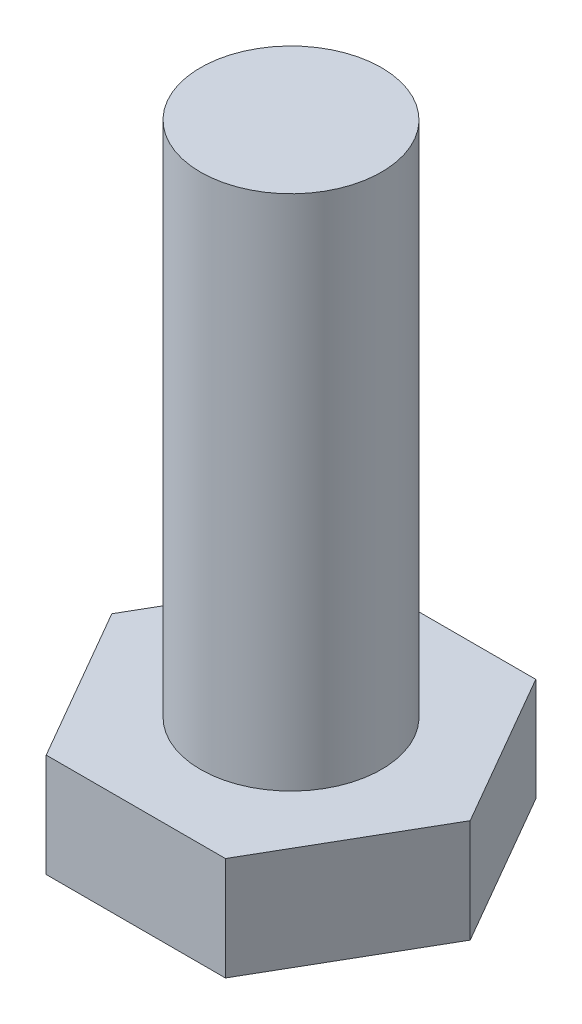
ISO-10303-21;
HEADER;
FILE_DESCRIPTION(('STEP AP214'),'2;1');
FILE_NAME('part.step','',(''),(''),'','','');
FILE_SCHEMA(('AUTOMOTIVE_DESIGN { 1 0 10303 214 1 1 1 1 }'));
ENDSEC;
DATA;
#1=APPLICATION_CONTEXT('core data for automotive mechanical design processes');
#2=APPLICATION_PROTOCOL_DEFINITION('international standard','automotive_design',2000,#1);
#3=PRODUCT_CONTEXT('',#1,'mechanical');
#4=PRODUCT('Part','Part','',(#3));
#5=PRODUCT_RELATED_PRODUCT_CATEGORY('part','',(#4));
#6=PRODUCT_DEFINITION_FORMATION('','',#4);
#7=PRODUCT_DEFINITION_CONTEXT('part definition',#1,'design');
#8=PRODUCT_DEFINITION('design','',#6,#7);
#9=PRODUCT_DEFINITION_SHAPE('','',#8);
#10=(LENGTH_UNIT() NAMED_UNIT(*) SI_UNIT(.MILLI.,.METRE.));
#11=(NAMED_UNIT(*) PLANE_ANGLE_UNIT() SI_UNIT($,.RADIAN.));
#12=(NAMED_UNIT(*) SI_UNIT($,.STERADIAN.) SOLID_ANGLE_UNIT());
#13=UNCERTAINTY_MEASURE_WITH_UNIT(LENGTH_MEASURE(1.E-05),#10,'distance_accuracy_value','');
#14=(GEOMETRIC_REPRESENTATION_CONTEXT(3) GLOBAL_UNCERTAINTY_ASSIGNED_CONTEXT((#13)) GLOBAL_UNIT_ASSIGNED_CONTEXT((#10,
#11,#12)) REPRESENTATION_CONTEXT('',''));
#15=CARTESIAN_POINT('',(0.,0.,0.));
#16=DIRECTION('',(0.,0.,1.));
#17=DIRECTION('',(1.,0.,0.));
#18=AXIS2_PLACEMENT_3D('',#15,#16,#17);
#19=CARTESIAN_POINT('',(1.73205080756888,2.,-3.));
#20=DIRECTION('',(0.,0.,1.));
#21=DIRECTION('',(1.,0.,0.));
#22=AXIS2_PLACEMENT_3D('',#19,#20,#21);
#23=PLANE('',#22);
#24=DIRECTION('',(-1.,0.,0.));
#25=VECTOR('',#24,1.);
#26=CARTESIAN_POINT('',(1.73205080756888,0.,-3.));
#27=LINE('',#26,#25);
#28=CARTESIAN_POINT('',(1.73205080756888,0.,-3.));
#29=VERTEX_POINT('',#28);
#30=CARTESIAN_POINT('',(-1.73205080756888,0.,-3.));
#31=VERTEX_POINT('',#30);
#32=EDGE_CURVE('E127',#29,#31,#27,.T.);
#33=ORIENTED_EDGE('',*,*,#32,.T.);
#34=DIRECTION('',(0.,-1.,0.));
#35=VECTOR('',#34,1.);
#36=CARTESIAN_POINT('',(-1.73205080756888,2.,-3.));
#37=LINE('',#36,#35);
#38=CARTESIAN_POINT('',(-1.73205080756888,2.,-3.));
#39=VERTEX_POINT('',#38);
#40=EDGE_CURVE('E44',#39,#31,#37,.T.);
#41=ORIENTED_EDGE('',*,*,#40,.F.);
#42=DIRECTION('',(-1.,0.,0.));
#43=VECTOR('',#42,1.);
#44=CARTESIAN_POINT('',(1.73205080756888,2.,-3.));
#45=LINE('',#44,#43);
#46=CARTESIAN_POINT('',(1.73205080756888,2.,-3.));
#47=VERTEX_POINT('',#46);
#48=EDGE_CURVE('E138',#47,#39,#45,.T.);
#49=ORIENTED_EDGE('',*,*,#48,.F.);
#50=DIRECTION('',(0.,-1.,0.));
#51=VECTOR('',#50,1.);
#52=CARTESIAN_POINT('',(1.73205080756888,2.,-3.));
#53=LINE('',#52,#51);
#54=EDGE_CURVE('E123',#47,#29,#53,.T.);
#55=ORIENTED_EDGE('',*,*,#54,.T.);
#56=EDGE_LOOP('',(#33,#41,#49,#55));
#57=FACE_BOUND('',#56,.T.);
#58=ADVANCED_FACE('F41',(#57),#23,.F.);
#59=CARTESIAN_POINT('',(-1.73205080756888,2.,-3.));
#60=DIRECTION('',(0.866025403784439,0.,0.5));
#61=DIRECTION('',(0.5,0.,-0.866025403784439));
#62=AXIS2_PLACEMENT_3D('',#59,#60,#61);
#63=PLANE('',#62);
#64=DIRECTION('',(-0.5,0.,0.866025403784439));
#65=VECTOR('',#64,1.);
#66=CARTESIAN_POINT('',(-1.73205080756888,0.,-3.));
#67=LINE('',#66,#65);
#68=CARTESIAN_POINT('',(-3.46410161513776,0.,0.));
#69=VERTEX_POINT('',#68);
#70=EDGE_CURVE('E130',#31,#69,#67,.T.);
#71=ORIENTED_EDGE('',*,*,#70,.T.);
#72=DIRECTION('',(0.,-1.,0.));
#73=VECTOR('',#72,1.);
#74=CARTESIAN_POINT('',(-3.46410161513776,2.,0.));
#75=LINE('',#74,#73);
#76=CARTESIAN_POINT('',(-3.46410161513776,2.,0.));
#77=VERTEX_POINT('',#76);
#78=EDGE_CURVE('E141',#77,#69,#75,.T.);
#79=ORIENTED_EDGE('',*,*,#78,.F.);
#80=DIRECTION('',(-0.5,0.,0.866025403784439));
#81=VECTOR('',#80,1.);
#82=CARTESIAN_POINT('',(-1.73205080756888,2.,-3.));
#83=LINE('',#82,#81);
#84=EDGE_CURVE('E96',#39,#77,#83,.T.);
#85=ORIENTED_EDGE('',*,*,#84,.F.);
#86=ORIENTED_EDGE('',*,*,#40,.T.);
#87=EDGE_LOOP('',(#71,#79,#85,#86));
#88=FACE_BOUND('',#87,.T.);
#89=ADVANCED_FACE('F146',(#88),#63,.F.);
#90=CARTESIAN_POINT('',(-3.46410161513776,2.,0.));
#91=DIRECTION('',(0.866025403784439,0.,-0.5));
#92=DIRECTION('',(-0.5,0.,-0.866025403784439));
#93=AXIS2_PLACEMENT_3D('',#90,#91,#92);
#94=PLANE('',#93);
#95=DIRECTION('',(0.5,0.,0.866025403784439));
#96=VECTOR('',#95,1.);
#97=CARTESIAN_POINT('',(-3.46410161513776,0.,0.));
#98=LINE('',#97,#96);
#99=CARTESIAN_POINT('',(-1.73205080756888,0.,3.));
#100=VERTEX_POINT('',#99);
#101=EDGE_CURVE('E133',#69,#100,#98,.T.);
#102=ORIENTED_EDGE('',*,*,#101,.T.);
#103=DIRECTION('',(0.,-1.,0.));
#104=VECTOR('',#103,1.);
#105=CARTESIAN_POINT('',(-1.73205080756888,2.,3.));
#106=LINE('',#105,#104);
#107=CARTESIAN_POINT('',(-1.73205080756888,2.,3.));
#108=VERTEX_POINT('',#107);
#109=EDGE_CURVE('E118',#108,#100,#106,.T.);
#110=ORIENTED_EDGE('',*,*,#109,.F.);
#111=DIRECTION('',(0.5,0.,0.866025403784439));
#112=VECTOR('',#111,1.);
#113=CARTESIAN_POINT('',(-3.46410161513776,2.,0.));
#114=LINE('',#113,#112);
#115=EDGE_CURVE('E109',#77,#108,#114,.T.);
#116=ORIENTED_EDGE('',*,*,#115,.F.);
#117=ORIENTED_EDGE('',*,*,#78,.T.);
#118=EDGE_LOOP('',(#102,#110,#116,#117));
#119=FACE_BOUND('',#118,.T.);
#120=ADVANCED_FACE('F152',(#119),#94,.F.);
#121=CARTESIAN_POINT('',(-1.73205080756888,2.,3.));
#122=DIRECTION('',(0.,0.,-1.));
#123=DIRECTION('',(-1.,0.,0.));
#124=AXIS2_PLACEMENT_3D('',#121,#122,#123);
#125=PLANE('',#124);
#126=DIRECTION('',(1.,0.,0.));
#127=VECTOR('',#126,1.);
#128=CARTESIAN_POINT('',(-1.73205080756888,0.,3.));
#129=LINE('',#128,#127);
#130=CARTESIAN_POINT('',(1.73205080756888,0.,3.));
#131=VERTEX_POINT('',#130);
#132=EDGE_CURVE('E117',#100,#131,#129,.T.);
#133=ORIENTED_EDGE('',*,*,#132,.T.);
#134=DIRECTION('',(0.,-1.,0.));
#135=VECTOR('',#134,1.);
#136=CARTESIAN_POINT('',(1.73205080756888,2.,3.));
#137=LINE('',#136,#135);
#138=CARTESIAN_POINT('',(1.73205080756888,2.,3.));
#139=VERTEX_POINT('',#138);
#140=EDGE_CURVE('E114',#139,#131,#137,.T.);
#141=ORIENTED_EDGE('',*,*,#140,.F.);
#142=DIRECTION('',(1.,0.,0.));
#143=VECTOR('',#142,1.);
#144=CARTESIAN_POINT('',(-1.73205080756888,2.,3.));
#145=LINE('',#144,#143);
#146=EDGE_CURVE('E103',#108,#139,#145,.T.);
#147=ORIENTED_EDGE('',*,*,#146,.F.);
#148=ORIENTED_EDGE('',*,*,#109,.T.);
#149=EDGE_LOOP('',(#133,#141,#147,#148));
#150=FACE_BOUND('',#149,.T.);
#151=ADVANCED_FACE('F115',(#150),#125,.F.);
#152=CARTESIAN_POINT('',(1.73205080756888,2.,3.));
#153=DIRECTION('',(-0.866025403784439,0.,-0.5));
#154=DIRECTION('',(-0.5,0.,0.866025403784439));
#155=AXIS2_PLACEMENT_3D('',#152,#153,#154);
#156=PLANE('',#155);
#157=DIRECTION('',(0.5,0.,-0.866025403784439));
#158=VECTOR('',#157,1.);
#159=CARTESIAN_POINT('',(1.73205080756888,0.,3.));
#160=LINE('',#159,#158);
#161=CARTESIAN_POINT('',(3.46410161513775,0.,0.));
#162=VERTEX_POINT('',#161);
#163=EDGE_CURVE('E81',#131,#162,#160,.T.);
#164=ORIENTED_EDGE('',*,*,#163,.T.);
#165=DIRECTION('',(0.,-1.,0.));
#166=VECTOR('',#165,1.);
#167=CARTESIAN_POINT('',(3.46410161513775,2.,0.));
#168=LINE('',#167,#166);
#169=CARTESIAN_POINT('',(3.46410161513775,2.,0.));
#170=VERTEX_POINT('',#169);
#171=EDGE_CURVE('E119',#170,#162,#168,.T.);
#172=ORIENTED_EDGE('',*,*,#171,.F.);
#173=DIRECTION('',(0.5,0.,-0.866025403784439));
#174=VECTOR('',#173,1.);
#175=CARTESIAN_POINT('',(1.73205080756888,2.,3.));
#176=LINE('',#175,#174);
#177=EDGE_CURVE('E107',#139,#170,#176,.T.);
#178=ORIENTED_EDGE('',*,*,#177,.F.);
#179=ORIENTED_EDGE('',*,*,#140,.T.);
#180=EDGE_LOOP('',(#164,#172,#178,#179));
#181=FACE_BOUND('',#180,.T.);
#182=ADVANCED_FACE('F121',(#181),#156,.F.);
#183=CARTESIAN_POINT('',(3.46410161513775,2.,0.));
#184=DIRECTION('',(-0.866025403784438,0.,0.5));
#185=DIRECTION('',(0.5,0.,0.866025403784439));
#186=AXIS2_PLACEMENT_3D('',#183,#184,#185);
#187=PLANE('',#186);
#188=DIRECTION('',(-0.5,0.,-0.866025403784438));
#189=VECTOR('',#188,1.);
#190=CARTESIAN_POINT('',(3.46410161513775,0.,0.));
#191=LINE('',#190,#189);
#192=EDGE_CURVE('E87',#162,#29,#191,.T.);
#193=ORIENTED_EDGE('',*,*,#192,.T.);
#194=ORIENTED_EDGE('',*,*,#54,.F.);
#195=DIRECTION('',(-0.5,0.,-0.866025403784438));
#196=VECTOR('',#195,1.);
#197=CARTESIAN_POINT('',(3.46410161513775,2.,0.));
#198=LINE('',#197,#196);
#199=EDGE_CURVE('E58',#170,#47,#198,.T.);
#200=ORIENTED_EDGE('',*,*,#199,.F.);
#201=ORIENTED_EDGE('',*,*,#171,.T.);
#202=EDGE_LOOP('',(#193,#194,#200,#201));
#203=FACE_BOUND('',#202,.T.);
#204=ADVANCED_FACE('F168',(#203),#187,.F.);
#205=CARTESIAN_POINT('',(0.,2.,0.));
#206=DIRECTION('',(0.,1.,0.));
#207=DIRECTION('',(0.,0.,1.));
#208=AXIS2_PLACEMENT_3D('',#205,#206,#207);
#209=PLANE('',#208);
#210=CARTESIAN_POINT('',(0.,2.,0.));
#211=DIRECTION('',(0.,1.,0.));
#212=DIRECTION('',(0.,0.,1.));
#213=AXIS2_PLACEMENT_3D('',#210,#211,#212);
#214=CIRCLE('',#213,1.75);
#215=CARTESIAN_POINT('',(0.,2.,1.75));
#216=VERTEX_POINT('',#215);
#217=EDGE_CURVE('E11',#216,#216,#214,.T.);
#218=ORIENTED_EDGE('',*,*,#217,.F.);
#219=EDGE_LOOP('',(#218));
#220=FACE_BOUND('',#219,.T.);
#221=ORIENTED_EDGE('',*,*,#48,.T.);
#222=ORIENTED_EDGE('',*,*,#84,.T.);
#223=ORIENTED_EDGE('',*,*,#115,.T.);
#224=ORIENTED_EDGE('',*,*,#146,.T.);
#225=ORIENTED_EDGE('',*,*,#177,.T.);
#226=ORIENTED_EDGE('',*,*,#199,.T.);
#227=EDGE_LOOP('',(#221,#222,#223,#224,#225,#226));
#228=FACE_BOUND('',#227,.T.);
#229=ADVANCED_FACE('F105',(#220,#228),#209,.T.);
#230=CARTESIAN_POINT('',(0.,0.,0.));
#231=DIRECTION('',(0.,1.,0.));
#232=DIRECTION('',(0.,0.,1.));
#233=AXIS2_PLACEMENT_3D('',#230,#231,#232);
#234=PLANE('',#233);
#235=ORIENTED_EDGE('',*,*,#32,.F.);
#236=ORIENTED_EDGE('',*,*,#192,.F.);
#237=ORIENTED_EDGE('',*,*,#163,.F.);
#238=ORIENTED_EDGE('',*,*,#132,.F.);
#239=ORIENTED_EDGE('',*,*,#101,.F.);
#240=ORIENTED_EDGE('',*,*,#70,.F.);
#241=EDGE_LOOP('',(#235,#236,#237,#238,#239,#240));
#242=FACE_BOUND('',#241,.T.);
#243=ADVANCED_FACE('F151',(#242),#234,.F.);
#244=CARTESIAN_POINT('',(0.,12.,0.));
#245=DIRECTION('',(0.,-1.,0.));
#246=DIRECTION('',(0.,0.,-1.));
#247=AXIS2_PLACEMENT_3D('',#244,#245,#246);
#248=CYLINDRICAL_SURFACE('',#247,1.75);
#249=CARTESIAN_POINT('',(0.,12.,0.));
#250=DIRECTION('',(0.,1.,0.));
#251=DIRECTION('',(0.,0.,1.));
#252=AXIS2_PLACEMENT_3D('',#249,#250,#251);
#253=CIRCLE('',#252,1.75);
#254=CARTESIAN_POINT('',(0.,12.,1.75));
#255=VERTEX_POINT('',#254);
#256=EDGE_CURVE('E131',#255,#255,#253,.T.);
#257=ORIENTED_EDGE('',*,*,#256,.F.);
#258=EDGE_LOOP('',(#257));
#259=FACE_BOUND('',#258,.T.);
#260=ORIENTED_EDGE('',*,*,#217,.T.);
#261=EDGE_LOOP('',(#260));
#262=FACE_BOUND('',#261,.T.);
#263=ADVANCED_FACE('F161',(#259,#262),#248,.T.);
#264=CARTESIAN_POINT('',(0.,12.,0.));
#265=DIRECTION('',(0.,1.,0.));
#266=DIRECTION('',(0.,0.,1.));
#267=AXIS2_PLACEMENT_3D('',#264,#265,#266);
#268=PLANE('',#267);
#269=ORIENTED_EDGE('',*,*,#256,.T.);
#270=EDGE_LOOP('',(#269));
#271=FACE_BOUND('',#270,.T.);
#272=ADVANCED_FACE('F159',(#271),#268,.T.);
#273=CLOSED_SHELL('',(#58,#89,#120,#151,#182,#204,#229,#243,#263,#272));
#274=MANIFOLD_SOLID_BREP('B2',#273);
#275=ADVANCED_BREP_SHAPE_REPRESENTATION('',(#18,#274),#14);
#276=SHAPE_DEFINITION_REPRESENTATION(#9,#275);
ENDSEC;
END-ISO-10303-21;
